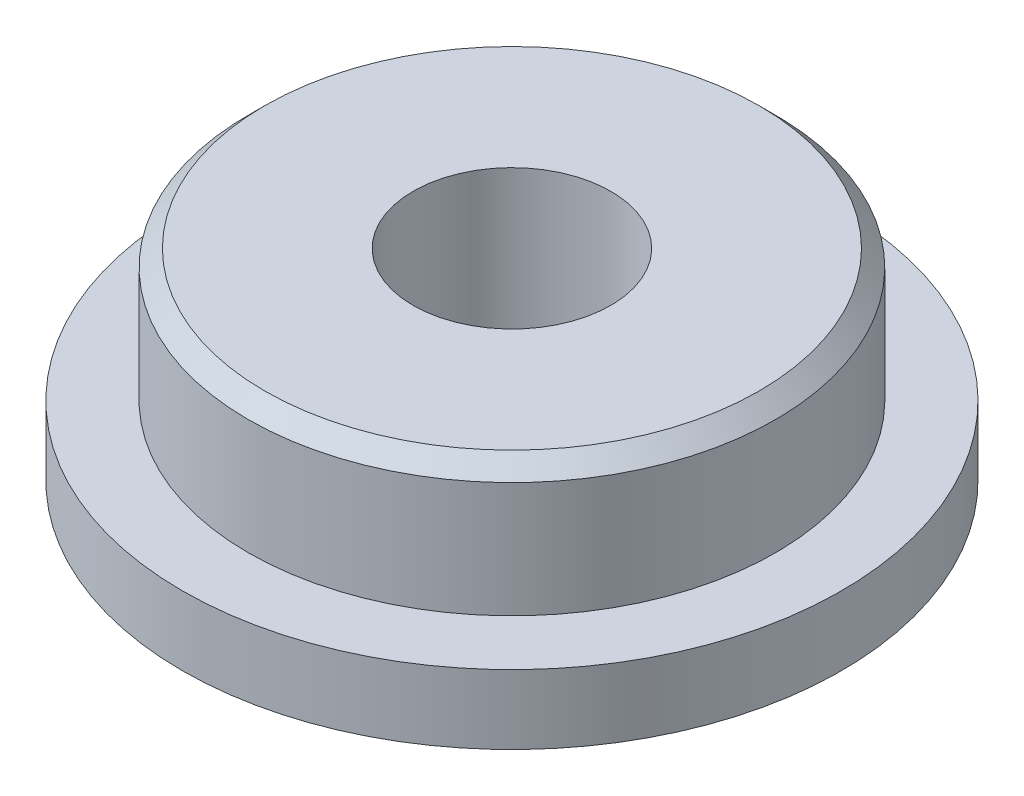
ISO-10303-21;
HEADER;
FILE_DESCRIPTION(('STEP AP214'),'2;1');
FILE_NAME('part.step','',(''),(''),'','','');
FILE_SCHEMA(('AUTOMOTIVE_DESIGN { 1 0 10303 214 1 1 1 1 }'));
ENDSEC;
DATA;
#1=APPLICATION_CONTEXT('core data for automotive mechanical design processes');
#2=APPLICATION_PROTOCOL_DEFINITION('international standard','automotive_design',2000,#1);
#3=PRODUCT_CONTEXT('',#1,'mechanical');
#4=PRODUCT('Part','Part','',(#3));
#5=PRODUCT_RELATED_PRODUCT_CATEGORY('part','',(#4));
#6=PRODUCT_DEFINITION_FORMATION('','',#4);
#7=PRODUCT_DEFINITION_CONTEXT('part definition',#1,'design');
#8=PRODUCT_DEFINITION('design','',#6,#7);
#9=PRODUCT_DEFINITION_SHAPE('','',#8);
#10=(LENGTH_UNIT() NAMED_UNIT(*) SI_UNIT(.MILLI.,.METRE.));
#11=(NAMED_UNIT(*) PLANE_ANGLE_UNIT() SI_UNIT($,.RADIAN.));
#12=(NAMED_UNIT(*) SI_UNIT($,.STERADIAN.) SOLID_ANGLE_UNIT());
#13=UNCERTAINTY_MEASURE_WITH_UNIT(LENGTH_MEASURE(1.E-05),#10,'distance_accuracy_value','');
#14=(GEOMETRIC_REPRESENTATION_CONTEXT(3) GLOBAL_UNCERTAINTY_ASSIGNED_CONTEXT((#13)) GLOBAL_UNIT_ASSIGNED_CONTEXT((#10,
#11,#12)) REPRESENTATION_CONTEXT('',''));
#15=CARTESIAN_POINT('',(0.,0.,0.));
#16=DIRECTION('',(0.,0.,1.));
#17=DIRECTION('',(1.,0.,0.));
#18=AXIS2_PLACEMENT_3D('',#15,#16,#17);
#19=CARTESIAN_POINT('',(0.,1.05,0.));
#20=DIRECTION('',(0.,-1.,0.));
#21=DIRECTION('',(0.,0.,-1.));
#22=AXIS2_PLACEMENT_3D('',#19,#20,#21);
#23=CYLINDRICAL_SURFACE('',#22,5.);
#24=CARTESIAN_POINT('',(0.,1.05,0.));
#25=DIRECTION('',(0.,1.,0.));
#26=DIRECTION('',(0.,0.,1.));
#27=AXIS2_PLACEMENT_3D('',#24,#25,#26);
#28=CIRCLE('',#27,5.);
#29=CARTESIAN_POINT('',(0.,1.05,5.));
#30=VERTEX_POINT('',#29);
#31=EDGE_CURVE('E62',#30,#30,#28,.T.);
#32=ORIENTED_EDGE('',*,*,#31,.F.);
#33=EDGE_LOOP('',(#32));
#34=FACE_BOUND('',#33,.T.);
#35=CARTESIAN_POINT('',(0.,0.,0.));
#36=DIRECTION('',(0.,1.,0.));
#37=DIRECTION('',(0.,0.,1.));
#38=AXIS2_PLACEMENT_3D('',#35,#36,#37);
#39=CIRCLE('',#38,5.);
#40=CARTESIAN_POINT('',(0.,0.,5.));
#41=VERTEX_POINT('',#40);
#42=EDGE_CURVE('E65',#41,#41,#39,.T.);
#43=ORIENTED_EDGE('',*,*,#42,.T.);
#44=EDGE_LOOP('',(#43));
#45=FACE_BOUND('',#44,.T.);
#46=ADVANCED_FACE('F43',(#34,#45),#23,.T.);
#47=CARTESIAN_POINT('',(0.,1.05,0.));
#48=DIRECTION('',(0.,1.,0.));
#49=DIRECTION('',(0.,0.,1.));
#50=AXIS2_PLACEMENT_3D('',#47,#48,#49);
#51=PLANE('',#50);
#52=CARTESIAN_POINT('',(0.,1.05,0.));
#53=DIRECTION('',(0.,1.,0.));
#54=DIRECTION('',(0.,0.,1.));
#55=AXIS2_PLACEMENT_3D('',#52,#53,#54);
#56=CIRCLE('',#55,4.);
#57=CARTESIAN_POINT('',(0.,1.05,4.));
#58=VERTEX_POINT('',#57);
#59=EDGE_CURVE('E57',#58,#58,#56,.T.);
#60=ORIENTED_EDGE('',*,*,#59,.F.);
#61=EDGE_LOOP('',(#60));
#62=FACE_BOUND('',#61,.T.);
#63=ORIENTED_EDGE('',*,*,#31,.T.);
#64=EDGE_LOOP('',(#63));
#65=FACE_BOUND('',#64,.T.);
#66=ADVANCED_FACE('F96',(#62,#65),#51,.T.);
#67=CARTESIAN_POINT('',(0.,0.,0.));
#68=DIRECTION('',(0.,1.,0.));
#69=DIRECTION('',(0.,0.,1.));
#70=AXIS2_PLACEMENT_3D('',#67,#68,#69);
#71=PLANE('',#70);
#72=CARTESIAN_POINT('',(0.,0.,0.));
#73=DIRECTION('',(0.,1.,0.));
#74=DIRECTION('',(0.,0.,1.));
#75=AXIS2_PLACEMENT_3D('',#72,#73,#74);
#76=CIRCLE('',#75,1.5);
#77=CARTESIAN_POINT('',(0.,0.,1.5));
#78=VERTEX_POINT('',#77);
#79=EDGE_CURVE('E69',#78,#78,#76,.T.);
#80=ORIENTED_EDGE('',*,*,#79,.T.);
#81=EDGE_LOOP('',(#80));
#82=FACE_BOUND('',#81,.T.);
#83=ORIENTED_EDGE('',*,*,#42,.F.);
#84=EDGE_LOOP('',(#83));
#85=FACE_BOUND('',#84,.T.);
#86=ADVANCED_FACE('F93',(#82,#85),#71,.F.);
#87=CARTESIAN_POINT('',(0.,3.05,0.));
#88=DIRECTION('',(0.,-1.,0.));
#89=DIRECTION('',(0.,0.,-1.));
#90=AXIS2_PLACEMENT_3D('',#87,#88,#89);
#91=CYLINDRICAL_SURFACE('',#90,4.);
#92=CARTESIAN_POINT('',(0.,2.8,0.));
#93=DIRECTION('',(0.,1.,0.));
#94=DIRECTION('',(0.,0.,1.));
#95=AXIS2_PLACEMENT_3D('',#92,#93,#94);
#96=CIRCLE('',#95,4.);
#97=CARTESIAN_POINT('',(0.,2.8,4.));
#98=VERTEX_POINT('',#97);
#99=EDGE_CURVE('E10',#98,#98,#96,.F.);
#100=ORIENTED_EDGE('',*,*,#99,.T.);
#101=EDGE_LOOP('',(#100));
#102=FACE_BOUND('',#101,.T.);
#103=ORIENTED_EDGE('',*,*,#59,.T.);
#104=EDGE_LOOP('',(#103));
#105=FACE_BOUND('',#104,.T.);
#106=ADVANCED_FACE('F86',(#102,#105),#91,.T.);
#107=CARTESIAN_POINT('',(0.,3.05,0.));
#108=DIRECTION('',(0.,1.,0.));
#109=DIRECTION('',(0.,0.,1.));
#110=AXIS2_PLACEMENT_3D('',#107,#108,#109);
#111=PLANE('',#110);
#112=CARTESIAN_POINT('',(0.,3.05,0.));
#113=DIRECTION('',(0.,1.,0.));
#114=DIRECTION('',(0.,0.,1.));
#115=AXIS2_PLACEMENT_3D('',#112,#113,#114);
#116=CIRCLE('',#115,3.75);
#117=CARTESIAN_POINT('',(0.,3.05,3.75));
#118=VERTEX_POINT('',#117);
#119=EDGE_CURVE('E52',#118,#118,#116,.T.);
#120=ORIENTED_EDGE('',*,*,#119,.T.);
#121=EDGE_LOOP('',(#120));
#122=FACE_BOUND('',#121,.T.);
#123=CARTESIAN_POINT('',(0.,3.05,0.));
#124=DIRECTION('',(0.,1.,0.));
#125=DIRECTION('',(0.,0.,1.));
#126=AXIS2_PLACEMENT_3D('',#123,#124,#125);
#127=CIRCLE('',#126,1.5);
#128=CARTESIAN_POINT('',(0.,3.05,1.5));
#129=VERTEX_POINT('',#128);
#130=EDGE_CURVE('E76',#129,#129,#127,.T.);
#131=ORIENTED_EDGE('',*,*,#130,.F.);
#132=EDGE_LOOP('',(#131));
#133=FACE_BOUND('',#132,.T.);
#134=ADVANCED_FACE('F84',(#122,#133),#111,.T.);
#135=CARTESIAN_POINT('',(0.,-8.95,0.));
#136=DIRECTION('',(0.,1.,0.));
#137=DIRECTION('',(0.,0.,1.));
#138=AXIS2_PLACEMENT_3D('',#135,#136,#137);
#139=CYLINDRICAL_SURFACE('',#138,1.5);
#140=ORIENTED_EDGE('',*,*,#130,.T.);
#141=EDGE_LOOP('',(#140));
#142=FACE_BOUND('',#141,.T.);
#143=ORIENTED_EDGE('',*,*,#79,.F.);
#144=EDGE_LOOP('',(#143));
#145=FACE_BOUND('',#144,.T.);
#146=ADVANCED_FACE('F81',(#142,#145),#139,.F.);
#147=CARTESIAN_POINT('',(0.,3.05,0.));
#148=DIRECTION('',(0.,-1.,0.));
#149=DIRECTION('',(0.,0.,-1.));
#150=AXIS2_PLACEMENT_3D('',#147,#148,#149);
#151=CONICAL_SURFACE('',#150,3.75,0.785398163397445);
#152=ORIENTED_EDGE('',*,*,#99,.F.);
#153=EDGE_LOOP('',(#152));
#154=FACE_BOUND('',#153,.T.);
#155=ORIENTED_EDGE('',*,*,#119,.F.);
#156=EDGE_LOOP('',(#155));
#157=FACE_BOUND('',#156,.T.);
#158=ADVANCED_FACE('F46',(#154,#157),#151,.T.);
#159=CLOSED_SHELL('',(#46,#66,#86,#106,#134,#146,#158));
#160=MANIFOLD_SOLID_BREP('B2',#159);
#161=ADVANCED_BREP_SHAPE_REPRESENTATION('',(#18,#160),#14);
#162=SHAPE_DEFINITION_REPRESENTATION(#9,#161);
ENDSEC;
END-ISO-10303-21;
